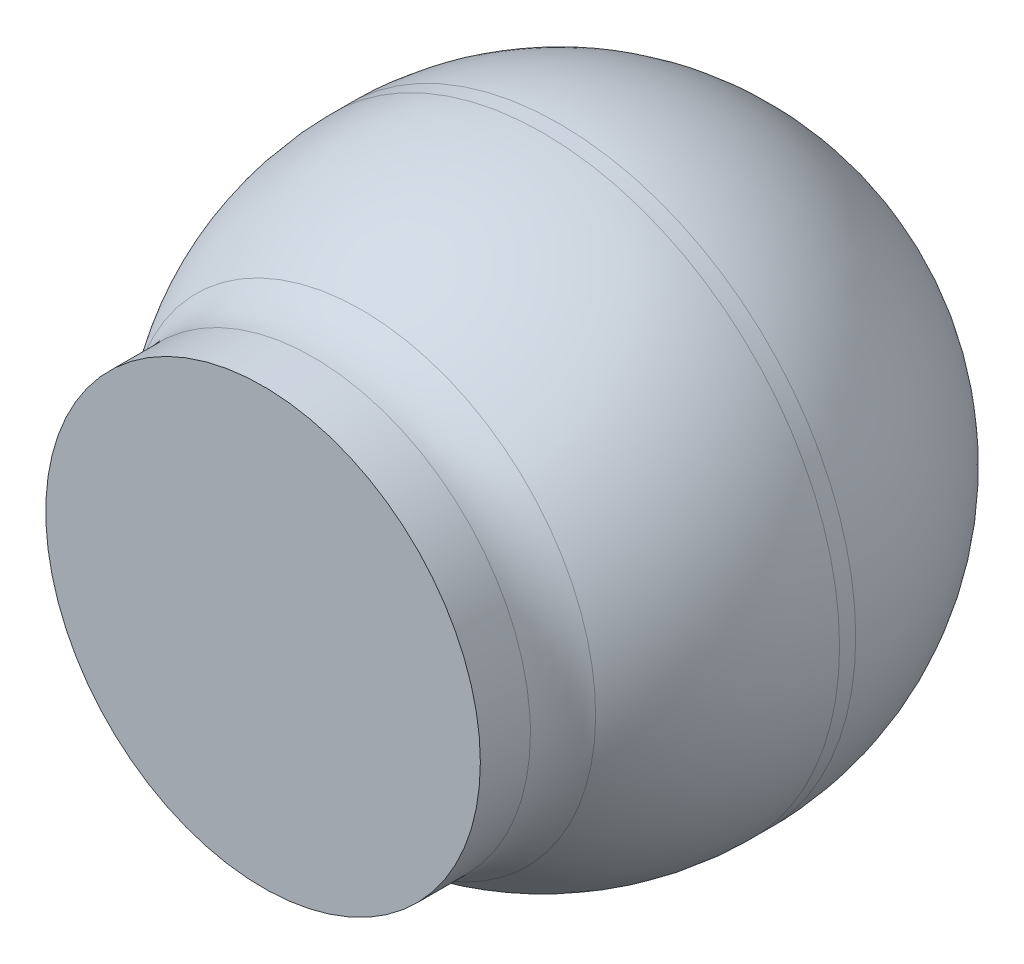
ISO-10303-21;
HEADER;
FILE_DESCRIPTION(('STEP AP214'),'2;1');
FILE_NAME('part.step','',(''),(''),'','','');
FILE_SCHEMA(('AUTOMOTIVE_DESIGN { 1 0 10303 214 1 1 1 1 }'));
ENDSEC;
DATA;
#1=APPLICATION_CONTEXT('core data for automotive mechanical design processes');
#2=APPLICATION_PROTOCOL_DEFINITION('international standard','automotive_design',2000,#1);
#3=PRODUCT_CONTEXT('',#1,'mechanical');
#4=PRODUCT('Part','Part','',(#3));
#5=PRODUCT_RELATED_PRODUCT_CATEGORY('part','',(#4));
#6=PRODUCT_DEFINITION_FORMATION('','',#4);
#7=PRODUCT_DEFINITION_CONTEXT('part definition',#1,'design');
#8=PRODUCT_DEFINITION('design','',#6,#7);
#9=PRODUCT_DEFINITION_SHAPE('','',#8);
#10=(LENGTH_UNIT() NAMED_UNIT(*) SI_UNIT(.MILLI.,.METRE.));
#11=(NAMED_UNIT(*) PLANE_ANGLE_UNIT() SI_UNIT($,.RADIAN.));
#12=(NAMED_UNIT(*) SI_UNIT($,.STERADIAN.) SOLID_ANGLE_UNIT());
#13=UNCERTAINTY_MEASURE_WITH_UNIT(LENGTH_MEASURE(1.E-05),#10,'distance_accuracy_value','');
#14=(GEOMETRIC_REPRESENTATION_CONTEXT(3) GLOBAL_UNCERTAINTY_ASSIGNED_CONTEXT((#13)) GLOBAL_UNIT_ASSIGNED_CONTEXT((#10,
#11,#12)) REPRESENTATION_CONTEXT('',''));
#15=CARTESIAN_POINT('',(0.,0.,0.));
#16=DIRECTION('',(0.,0.,1.));
#17=DIRECTION('',(1.,0.,0.));
#18=AXIS2_PLACEMENT_3D('',#15,#16,#17);
#19=CARTESIAN_POINT('',(-6.912919922269,-1.511349291452,10.006534503384));
#20=DIRECTION('',(0.,0.,-1.));
#21=DIRECTION('',(-1.,0.,0.));
#22=AXIS2_PLACEMENT_3D('',#19,#20,#21);
#23=PLANE('',#22);
#24=CARTESIAN_POINT('',(-6.912919922269,-1.511349291452,10.006534503384));
#25=DIRECTION('',(0.,0.,1.));
#26=DIRECTION('',(1.,0.,0.));
#27=AXIS2_PLACEMENT_3D('',#24,#25,#26);
#28=CIRCLE('',#27,0.275);
#29=CARTESIAN_POINT('',(-6.637919922269,-1.511349291452,10.006534503384));
#30=VERTEX_POINT('',#29);
#31=EDGE_CURVE('E20',#30,#30,#28,.F.);
#32=ORIENTED_EDGE('',*,*,#31,.F.);
#33=EDGE_LOOP('',(#32));
#34=FACE_BOUND('',#33,.T.);
#35=ADVANCED_FACE('F17',(#34),#23,.F.);
#36=CARTESIAN_POINT('',(-6.912919922269,-1.511349291452,9.906534503384));
#37=DIRECTION('',(0.,0.,1.));
#38=DIRECTION('',(1.,0.,0.));
#39=AXIS2_PLACEMENT_3D('',#36,#37,#38);
#40=CYLINDRICAL_SURFACE('',#39,0.275);
#41=CARTESIAN_POINT('',(-6.912919922269,-1.511349291452,9.943180457728));
#42=DIRECTION('',(0.,0.,-1.));
#43=DIRECTION('',(0.996700902337582,0.0811622527992462,0.));
#44=AXIS2_PLACEMENT_3D('',#41,#42,#43);
#45=CIRCLE('',#44,0.275);
#46=CARTESIAN_POINT('',(-6.63882717412617,-1.48902967193221,9.943180457728));
#47=VERTEX_POINT('',#46);
#48=EDGE_CURVE('E65',#47,#47,#45,.F.);
#49=ORIENTED_EDGE('',*,*,#48,.T.);
#50=EDGE_LOOP('',(#49));
#51=FACE_BOUND('',#50,.T.);
#52=ORIENTED_EDGE('',*,*,#31,.T.);
#53=EDGE_LOOP('',(#52));
#54=FACE_BOUND('',#53,.T.);
#55=ADVANCED_FACE('F62',(#51,#54),#40,.T.);
#56=CARTESIAN_POINT('',(-6.912919922269,-1.511349291452,9.943180457728));
#57=DIRECTION('',(0.,0.,-1.));
#58=DIRECTION('',(0.996700902337583,0.081162252799246,0.));
#59=AXIS2_PLACEMENT_3D('',#56,#57,#58);
#60=TOROIDAL_SURFACE('',#59,0.375,0.1);
#61=ORIENTED_EDGE('',*,*,#48,.F.);
#62=EDGE_LOOP('',(#61));
#63=FACE_BOUND('',#62,.T.);
#64=CARTESIAN_POINT('',(-6.912919922269,-1.511349291452,9.881744931236));
#65=DIRECTION('',(0.,0.,-1.));
#66=DIRECTION('',(-0.996700902337598,-0.0811622527990615,0.));
#67=AXIS2_PLACEMENT_3D('',#64,#65,#66);
#68=CIRCLE('',#67,0.296097046412665);
#69=CARTESIAN_POINT('',(-7.208040115608,-1.535381194786,9.881744931236));
#70=VERTEX_POINT('',#69);
#71=EDGE_CURVE('E39',#70,#70,#68,.T.);
#72=ORIENTED_EDGE('',*,*,#71,.F.);
#73=EDGE_LOOP('',(#72));
#74=FACE_BOUND('',#73,.T.);
#75=ADVANCED_FACE('F57',(#63,#74),#60,.F.);
#76=CARTESIAN_POINT('',(-7.286682760645,-1.541785136252,9.651976062157));
#77=CARTESIAN_POINT('',(-7.286682760645,-1.541785136252,9.701461392103));
#78=CARTESIAN_POINT('',(-7.278526217348,-1.541120941579,9.750947004335));
#79=CARTESIAN_POINT('',(-7.262207085349,-1.539792059952,9.798626332798));
#80=CARTESIAN_POINT('',(-7.238341390838,-1.537848654938,9.842699544317));
#81=CARTESIAN_POINT('',(-7.208040115608,-1.535381194786,9.881744931236));
#82=(BOUNDED_CURVE() B_SPLINE_CURVE(5,(#76,#77,#78,#79,#80,#81),.UNSPECIFIED.,.F.,
.F.) B_SPLINE_CURVE_WITH_KNOTS((6,6),(0.,0.661568582165),
.UNSPECIFIED.) CURVE() GEOMETRIC_REPRESENTATION_ITEM() RATIONAL_B_SPLINE_CURVE((1.,1.,1.,1.,1.,1.)) REPRESENTATION_ITEM(''));
#83=CARTESIAN_POINT('',(-6.912919922269,-1.511349291452,9.651976062157));
#84=DIRECTION('',(0.,0.,-1.));
#85=AXIS1_PLACEMENT('',#83,#84);
#86=SURFACE_OF_REVOLUTION('',#82,#85);
#87=CARTESIAN_POINT('',(-6.912919922269,-1.511349291452,9.651976062157));
#88=DIRECTION('',(0.,0.,1.));
#89=DIRECTION('',(1.,0.,0.));
#90=AXIS2_PLACEMENT_3D('',#87,#88,#89);
#91=CIRCLE('',#90,0.375);
#92=CARTESIAN_POINT('',(-6.537919922269,-1.511349291452,9.651976062157));
#93=VERTEX_POINT('',#92);
#94=EDGE_CURVE('E36',#93,#93,#91,.F.);
#95=ORIENTED_EDGE('',*,*,#94,.F.);
#96=EDGE_LOOP('',(#95));
#97=FACE_BOUND('',#96,.T.);
#98=ORIENTED_EDGE('',*,*,#71,.T.);
#99=EDGE_LOOP('',(#98));
#100=FACE_BOUND('',#99,.T.);
#101=ADVANCED_FACE('F53',(#97,#100),#86,.F.);
#102=CARTESIAN_POINT('',(-6.912919922269,-1.511349291452,9.256534503384));
#103=DIRECTION('',(0.,0.,1.));
#104=DIRECTION('',(1.,0.,0.));
#105=AXIS2_PLACEMENT_3D('',#102,#103,#104);
#106=CYLINDRICAL_SURFACE('',#105,0.375);
#107=CARTESIAN_POINT('',(-6.912919922269,-1.511349291452,9.631534503384));
#108=DIRECTION('',(0.,0.,-1.));
#109=DIRECTION('',(0.0811622527992356,-0.996700902337583,0.));
#110=AXIS2_PLACEMENT_3D('',#107,#108,#109);
#111=CIRCLE('',#110,0.375);
#112=CARTESIAN_POINT('',(-6.88248407746929,-1.88511212982859,9.631534503384));
#113=VERTEX_POINT('',#112);
#114=CARTESIAN_POINT('',(-6.94335576706871,-1.13758645307541,9.631534503384));
#115=VERTEX_POINT('',#114);
#116=EDGE_CURVE('E11',#113,#115,#111,.T.);
#117=ORIENTED_EDGE('',*,*,#116,.F.);
#118=CARTESIAN_POINT('',(-6.912919922269,-1.511349291452,9.631534503384));
#119=DIRECTION('',(0.,0.,1.));
#120=DIRECTION('',(0.0811622527992365,-0.996700902337583,0.));
#121=AXIS2_PLACEMENT_3D('',#118,#119,#120);
#122=CIRCLE('',#121,0.375);
#123=EDGE_CURVE('E25',#115,#113,#122,.F.);
#124=ORIENTED_EDGE('',*,*,#123,.F.);
#125=EDGE_LOOP('',(#117,#124));
#126=FACE_BOUND('',#125,.T.);
#127=ORIENTED_EDGE('',*,*,#94,.T.);
#128=EDGE_LOOP('',(#127));
#129=FACE_BOUND('',#128,.T.);
#130=ADVANCED_FACE('F34',(#126,#129),#106,.T.);
#131=CARTESIAN_POINT('',(-6.912919922269,-1.511349291452,9.631534503384));
#132=DIRECTION('',(0.0811622527992361,-0.996700902337583,0.));
#133=DIRECTION('',(-0.996700902337583,-0.0811622527992361,0.));
#134=AXIS2_PLACEMENT_3D('',#131,#132,#133);
#135=SPHERICAL_SURFACE('',#134,0.375);
#136=ORIENTED_EDGE('',*,*,#123,.T.);
#137=ORIENTED_EDGE('',*,*,#116,.T.);
#138=EDGE_LOOP('',(#136,#137));
#139=FACE_BOUND('',#138,.T.);
#140=ADVANCED_FACE('F32',(#139),#135,.T.);
#141=CLOSED_SHELL('',(#35,#55,#75,#101,#130,#140));
#142=MANIFOLD_SOLID_BREP('B1',#141);
#143=ADVANCED_BREP_SHAPE_REPRESENTATION('',(#18,#142),#14);
#144=SHAPE_DEFINITION_REPRESENTATION(#9,#143);
ENDSEC;
END-ISO-10303-21;
